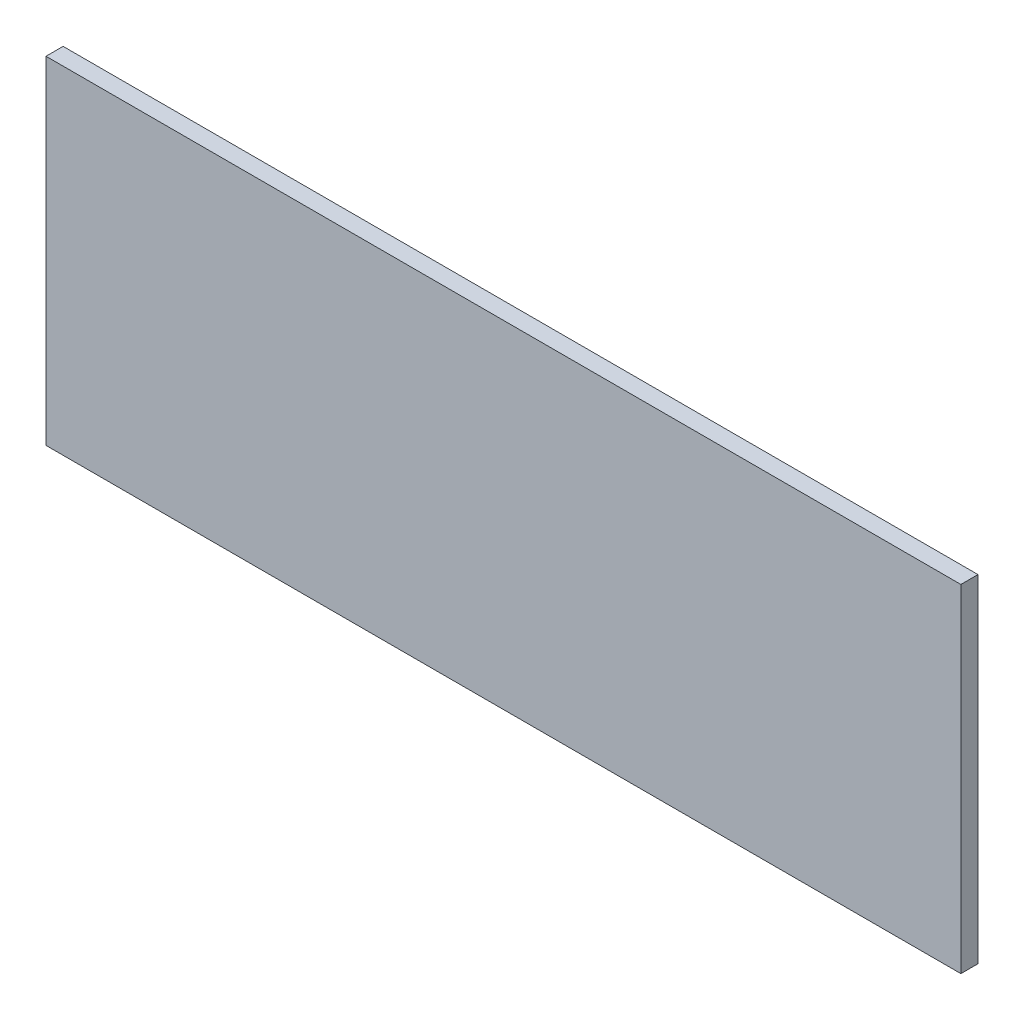
ISO-10303-21;
HEADER;
FILE_DESCRIPTION(('STEP AP214'),'2;1');
FILE_NAME('part.step','',(''),(''),'','','');
FILE_SCHEMA(('AUTOMOTIVE_DESIGN { 1 0 10303 214 1 1 1 1 }'));
ENDSEC;
DATA;
#1=APPLICATION_CONTEXT('core data for automotive mechanical design processes');
#2=APPLICATION_PROTOCOL_DEFINITION('international standard','automotive_design',2000,#1);
#3=PRODUCT_CONTEXT('',#1,'mechanical');
#4=PRODUCT('Part','Part','',(#3));
#5=PRODUCT_RELATED_PRODUCT_CATEGORY('part','',(#4));
#6=PRODUCT_DEFINITION_FORMATION('','',#4);
#7=PRODUCT_DEFINITION_CONTEXT('part definition',#1,'design');
#8=PRODUCT_DEFINITION('design','',#6,#7);
#9=PRODUCT_DEFINITION_SHAPE('','',#8);
#10=(LENGTH_UNIT() NAMED_UNIT(*) SI_UNIT(.MILLI.,.METRE.));
#11=(NAMED_UNIT(*) PLANE_ANGLE_UNIT() SI_UNIT($,.RADIAN.));
#12=(NAMED_UNIT(*) SI_UNIT($,.STERADIAN.) SOLID_ANGLE_UNIT());
#13=UNCERTAINTY_MEASURE_WITH_UNIT(LENGTH_MEASURE(1.E-05),#10,'distance_accuracy_value','');
#14=(GEOMETRIC_REPRESENTATION_CONTEXT(3) GLOBAL_UNCERTAINTY_ASSIGNED_CONTEXT((#13)) GLOBAL_UNIT_ASSIGNED_CONTEXT((#10,
#11,#12)) REPRESENTATION_CONTEXT('',''));
#15=CARTESIAN_POINT('',(0.,0.,0.));
#16=DIRECTION('',(0.,0.,1.));
#17=DIRECTION('',(1.,0.,0.));
#18=AXIS2_PLACEMENT_3D('',#15,#16,#17);
#19=CARTESIAN_POINT('',(81.8669967651367,56.3370018005371,0.));
#20=DIRECTION('',(0.,1.,0.));
#21=DIRECTION('',(1.,0.,0.));
#22=AXIS2_PLACEMENT_3D('',#19,#20,#21);
#23=PLANE('',#22);
#24=DIRECTION('',(1.,0.,0.));
#25=VECTOR('',#24,1.);
#26=CARTESIAN_POINT('',(81.8669967651367,56.3370018005371,0.03556));
#27=LINE('',#26,#25);
#28=CARTESIAN_POINT('',(81.8669967651367,56.3370018005371,0.03556));
#29=VERTEX_POINT('',#28);
#30=CARTESIAN_POINT('',(83.7669982910156,56.3370018005371,0.03556));
#31=VERTEX_POINT('',#30);
#32=EDGE_CURVE('E11',#29,#31,#27,.T.);
#33=ORIENTED_EDGE('',*,*,#32,.F.);
#34=DIRECTION('',(0.,0.,1.));
#35=VECTOR('',#34,1.);
#36=CARTESIAN_POINT('',(81.8669967651367,56.3370018005371,0.));
#37=LINE('',#36,#35);
#38=CARTESIAN_POINT('',(81.8669967651367,56.3370018005371,0.));
#39=VERTEX_POINT('',#38);
#40=EDGE_CURVE('E24',#39,#29,#37,.T.);
#41=ORIENTED_EDGE('',*,*,#40,.F.);
#42=DIRECTION('',(1.,0.,0.));
#43=VECTOR('',#42,1.);
#44=CARTESIAN_POINT('',(81.8669967651367,56.3370018005371,0.));
#45=LINE('',#44,#43);
#46=CARTESIAN_POINT('',(83.7669982910156,56.3370018005371,0.));
#47=VERTEX_POINT('',#46);
#48=EDGE_CURVE('E75',#39,#47,#45,.T.);
#49=ORIENTED_EDGE('',*,*,#48,.T.);
#50=DIRECTION('',(0.,0.,1.));
#51=VECTOR('',#50,1.);
#52=CARTESIAN_POINT('',(83.7669982910156,56.3370018005371,0.));
#53=LINE('',#52,#51);
#54=EDGE_CURVE('E37',#47,#31,#53,.T.);
#55=ORIENTED_EDGE('',*,*,#54,.T.);
#56=EDGE_LOOP('',(#33,#41,#49,#55));
#57=FACE_BOUND('',#56,.T.);
#58=ADVANCED_FACE('F17',(#57),#23,.F.);
#59=CARTESIAN_POINT('',(83.7669982910156,56.3370018005371,0.));
#60=DIRECTION('',(-1.,0.,0.));
#61=DIRECTION('',(0.,1.,0.));
#62=AXIS2_PLACEMENT_3D('',#59,#60,#61);
#63=PLANE('',#62);
#64=DIRECTION('',(0.,1.,0.));
#65=VECTOR('',#64,1.);
#66=CARTESIAN_POINT('',(83.7669982910156,56.3370018005371,0.03556));
#67=LINE('',#66,#65);
#68=CARTESIAN_POINT('',(83.7669982910156,57.0369987487793,0.03556));
#69=VERTEX_POINT('',#68);
#70=EDGE_CURVE('E83',#31,#69,#67,.T.);
#71=ORIENTED_EDGE('',*,*,#70,.F.);
#72=ORIENTED_EDGE('',*,*,#54,.F.);
#73=DIRECTION('',(0.,1.,0.));
#74=VECTOR('',#73,1.);
#75=CARTESIAN_POINT('',(83.7669982910156,56.3370018005371,0.));
#76=LINE('',#75,#74);
#77=CARTESIAN_POINT('',(83.7669982910156,57.0369987487793,0.));
#78=VERTEX_POINT('',#77);
#79=EDGE_CURVE('E81',#47,#78,#76,.T.);
#80=ORIENTED_EDGE('',*,*,#79,.T.);
#81=DIRECTION('',(0.,0.,1.));
#82=VECTOR('',#81,1.);
#83=CARTESIAN_POINT('',(83.7669982910156,57.0369987487793,0.));
#84=LINE('',#83,#82);
#85=EDGE_CURVE('E67',#78,#69,#84,.T.);
#86=ORIENTED_EDGE('',*,*,#85,.T.);
#87=EDGE_LOOP('',(#71,#72,#80,#86));
#88=FACE_BOUND('',#87,.T.);
#89=ADVANCED_FACE('F89',(#88),#63,.F.);
#90=CARTESIAN_POINT('',(83.7669982910156,57.0369987487793,0.));
#91=DIRECTION('',(0.,-1.,0.));
#92=DIRECTION('',(-1.,0.,0.));
#93=AXIS2_PLACEMENT_3D('',#90,#91,#92);
#94=PLANE('',#93);
#95=DIRECTION('',(-1.,0.,0.));
#96=VECTOR('',#95,1.);
#97=CARTESIAN_POINT('',(83.7669982910156,57.0369987487793,0.03556));
#98=LINE('',#97,#96);
#99=CARTESIAN_POINT('',(81.8669967651367,57.0369987487793,0.03556));
#100=VERTEX_POINT('',#99);
#101=EDGE_CURVE('E71',#69,#100,#98,.T.);
#102=ORIENTED_EDGE('',*,*,#101,.F.);
#103=ORIENTED_EDGE('',*,*,#85,.F.);
#104=DIRECTION('',(-1.,0.,0.));
#105=VECTOR('',#104,1.);
#106=CARTESIAN_POINT('',(83.7669982910156,57.0369987487793,0.));
#107=LINE('',#106,#105);
#108=CARTESIAN_POINT('',(81.8669967651367,57.0369987487793,0.));
#109=VERTEX_POINT('',#108);
#110=EDGE_CURVE('E63',#78,#109,#107,.T.);
#111=ORIENTED_EDGE('',*,*,#110,.T.);
#112=DIRECTION('',(0.,0.,1.));
#113=VECTOR('',#112,1.);
#114=CARTESIAN_POINT('',(81.8669967651367,57.0369987487793,0.));
#115=LINE('',#114,#113);
#116=EDGE_CURVE('E53',#109,#100,#115,.T.);
#117=ORIENTED_EDGE('',*,*,#116,.T.);
#118=EDGE_LOOP('',(#102,#103,#111,#117));
#119=FACE_BOUND('',#118,.T.);
#120=ADVANCED_FACE('F66',(#119),#94,.F.);
#121=CARTESIAN_POINT('',(81.8669967651367,57.0369987487793,0.));
#122=DIRECTION('',(1.,0.,0.));
#123=DIRECTION('',(0.,-1.,0.));
#124=AXIS2_PLACEMENT_3D('',#121,#122,#123);
#125=PLANE('',#124);
#126=DIRECTION('',(0.,-1.,0.));
#127=VECTOR('',#126,1.);
#128=CARTESIAN_POINT('',(81.8669967651367,57.0369987487793,0.03556));
#129=LINE('',#128,#127);
#130=EDGE_CURVE('E59',#100,#29,#129,.T.);
#131=ORIENTED_EDGE('',*,*,#130,.F.);
#132=ORIENTED_EDGE('',*,*,#116,.F.);
#133=DIRECTION('',(0.,-1.,0.));
#134=VECTOR('',#133,1.);
#135=CARTESIAN_POINT('',(81.8669967651367,57.0369987487793,0.));
#136=LINE('',#135,#134);
#137=EDGE_CURVE('E57',#109,#39,#136,.T.);
#138=ORIENTED_EDGE('',*,*,#137,.T.);
#139=ORIENTED_EDGE('',*,*,#40,.T.);
#140=EDGE_LOOP('',(#131,#132,#138,#139));
#141=FACE_BOUND('',#140,.T.);
#142=ADVANCED_FACE('F55',(#141),#125,.F.);
#143=CARTESIAN_POINT('',(81.8669967651367,56.3370018005371,0.));
#144=DIRECTION('',(0.,0.,-1.));
#145=DIRECTION('',(-1.,0.,0.));
#146=AXIS2_PLACEMENT_3D('',#143,#144,#145);
#147=PLANE('',#146);
#148=ORIENTED_EDGE('',*,*,#137,.F.);
#149=ORIENTED_EDGE('',*,*,#110,.F.);
#150=ORIENTED_EDGE('',*,*,#79,.F.);
#151=ORIENTED_EDGE('',*,*,#48,.F.);
#152=EDGE_LOOP('',(#148,#149,#150,#151));
#153=FACE_BOUND('',#152,.T.);
#154=ADVANCED_FACE('F74',(#153),#147,.T.);
#155=CARTESIAN_POINT('',(81.8669967651367,56.3370018005371,0.03556));
#156=DIRECTION('',(0.,0.,-1.));
#157=DIRECTION('',(-1.,0.,0.));
#158=AXIS2_PLACEMENT_3D('',#155,#156,#157);
#159=PLANE('',#158);
#160=ORIENTED_EDGE('',*,*,#32,.T.);
#161=ORIENTED_EDGE('',*,*,#70,.T.);
#162=ORIENTED_EDGE('',*,*,#101,.T.);
#163=ORIENTED_EDGE('',*,*,#130,.T.);
#164=EDGE_LOOP('',(#160,#161,#162,#163));
#165=FACE_BOUND('',#164,.T.);
#166=ADVANCED_FACE('F91',(#165),#159,.F.);
#167=CLOSED_SHELL('',(#58,#89,#120,#142,#154,#166));
#168=MANIFOLD_SOLID_BREP('B1',#167);
#169=ADVANCED_BREP_SHAPE_REPRESENTATION('',(#18,#168),#14);
#170=SHAPE_DEFINITION_REPRESENTATION(#9,#169);
ENDSEC;
END-ISO-10303-21;
